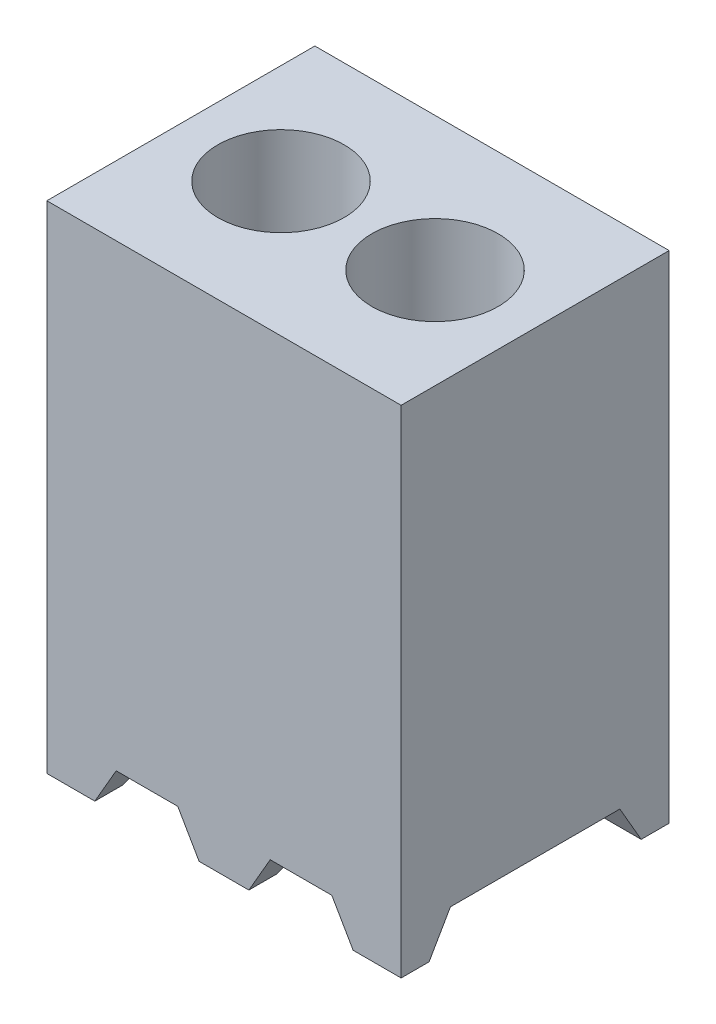
ISO-10303-21;
HEADER;
FILE_DESCRIPTION(('STEP AP214'),'2;1');
FILE_NAME('part.step','',(''),(''),'','','');
FILE_SCHEMA(('AUTOMOTIVE_DESIGN { 1 0 10303 214 1 1 1 1 }'));
ENDSEC;
DATA;
#1=APPLICATION_CONTEXT('core data for automotive mechanical design processes');
#2=APPLICATION_PROTOCOL_DEFINITION('international standard','automotive_design',2000,#1);
#3=PRODUCT_CONTEXT('',#1,'mechanical');
#4=PRODUCT('Part','Part','',(#3));
#5=PRODUCT_RELATED_PRODUCT_CATEGORY('part','',(#4));
#6=PRODUCT_DEFINITION_FORMATION('','',#4);
#7=PRODUCT_DEFINITION_CONTEXT('part definition',#1,'design');
#8=PRODUCT_DEFINITION('design','',#6,#7);
#9=PRODUCT_DEFINITION_SHAPE('','',#8);
#10=(LENGTH_UNIT() NAMED_UNIT(*) SI_UNIT(.MILLI.,.METRE.));
#11=(NAMED_UNIT(*) PLANE_ANGLE_UNIT() SI_UNIT($,.RADIAN.));
#12=(NAMED_UNIT(*) SI_UNIT($,.STERADIAN.) SOLID_ANGLE_UNIT());
#13=UNCERTAINTY_MEASURE_WITH_UNIT(LENGTH_MEASURE(1.E-05),#10,'distance_accuracy_value','');
#14=(GEOMETRIC_REPRESENTATION_CONTEXT(3) GLOBAL_UNCERTAINTY_ASSIGNED_CONTEXT((#13)) GLOBAL_UNIT_ASSIGNED_CONTEXT((#10,
#11,#12)) REPRESENTATION_CONTEXT('',''));
#15=CARTESIAN_POINT('',(0.,0.,0.));
#16=DIRECTION('',(0.,0.,1.));
#17=DIRECTION('',(1.,0.,0.));
#18=AXIS2_PLACEMENT_3D('',#15,#16,#17);
#19=CARTESIAN_POINT('',(0.,-4.0894,0.));
#20=DIRECTION('',(0.,1.,0.));
#21=DIRECTION('',(0.,0.,1.));
#22=AXIS2_PLACEMENT_3D('',#19,#20,#21);
#23=PLANE('',#22);
#24=DIRECTION('',(1.,0.,0.));
#25=VECTOR('',#24,1.);
#26=CARTESIAN_POINT('',(0.,-4.0894,0.));
#27=LINE('',#26,#25);
#28=CARTESIAN_POINT('',(2.525476362049,-4.0894,0.));
#29=VERTEX_POINT('',#28);
#30=CARTESIAN_POINT('',(2.92099999999999,-4.0894,0.));
#31=VERTEX_POINT('',#30);
#32=EDGE_CURVE('E309',#29,#31,#27,.T.);
#33=ORIENTED_EDGE('',*,*,#32,.F.);
#34=DIRECTION('',(0.,0.,1.));
#35=VECTOR('',#34,1.);
#36=CARTESIAN_POINT('',(2.525476362049,-4.0894,-2.2098));
#37=LINE('',#36,#35);
#38=CARTESIAN_POINT('',(2.525476362049,-4.0894,-0.230423637951));
#39=VERTEX_POINT('',#38);
#40=EDGE_CURVE('E216',#39,#29,#37,.T.);
#41=ORIENTED_EDGE('',*,*,#40,.F.);
#42=DIRECTION('',(1.,0.,0.));
#43=VECTOR('',#42,1.);
#44=CARTESIAN_POINT('',(0.,-4.0894,-0.230423637951));
#45=LINE('',#44,#43);
#46=CARTESIAN_POINT('',(2.92099999999999,-4.0894,-0.230423637951));
#47=VERTEX_POINT('',#46);
#48=EDGE_CURVE('E26',#39,#47,#45,.T.);
#49=ORIENTED_EDGE('',*,*,#48,.T.);
#50=DIRECTION('',(0.,0.,-1.));
#51=VECTOR('',#50,1.);
#52=CARTESIAN_POINT('',(2.92099999999999,-4.0894,0.));
#53=LINE('',#52,#51);
#54=EDGE_CURVE('E316',#31,#47,#53,.T.);
#55=ORIENTED_EDGE('',*,*,#54,.F.);
#56=EDGE_LOOP('',(#33,#41,#49,#55));
#57=FACE_BOUND('',#56,.T.);
#58=ADVANCED_FACE('F16',(#57),#23,.F.);
#59=DIRECTION('',(-1.,0.,0.));
#60=VECTOR('',#59,1.);
#61=CARTESIAN_POINT('',(0.,-4.0894,-1.97937636204899));
#62=LINE('',#61,#60);
#63=CARTESIAN_POINT('',(2.92099999999999,-4.0894,-1.97937636204899));
#64=VERTEX_POINT('',#63);
#65=CARTESIAN_POINT('',(2.525476362049,-4.0894,-1.97937636204899));
#66=VERTEX_POINT('',#65);
#67=EDGE_CURVE('E343',#64,#66,#62,.T.);
#68=ORIENTED_EDGE('',*,*,#67,.T.);
#69=CARTESIAN_POINT('',(2.525476362049,-4.0894,-2.2098));
#70=VERTEX_POINT('',#69);
#71=EDGE_CURVE('E214',#70,#66,#37,.T.);
#72=ORIENTED_EDGE('',*,*,#71,.F.);
#73=DIRECTION('',(-1.,0.,0.));
#74=VECTOR('',#73,1.);
#75=CARTESIAN_POINT('',(2.92099999999999,-4.0894,-2.20979999999999));
#76=LINE('',#75,#74);
#77=CARTESIAN_POINT('',(2.92099999999999,-4.0894,-2.20979999999999));
#78=VERTEX_POINT('',#77);
#79=EDGE_CURVE('E320',#78,#70,#76,.T.);
#80=ORIENTED_EDGE('',*,*,#79,.F.);
#81=EDGE_CURVE('E314',#64,#78,#53,.T.);
#82=ORIENTED_EDGE('',*,*,#81,.F.);
#83=EDGE_LOOP('',(#68,#72,#80,#82));
#84=FACE_BOUND('',#83,.T.);
#85=ADVANCED_FACE('F395',(#84),#23,.F.);
#86=CARTESIAN_POINT('',(-60.96,-3.7846,-0.4064));
#87=DIRECTION('',(0.,0.500000000000004,0.866025403784436));
#88=DIRECTION('',(0.,-0.866025403784436,0.500000000000004));
#89=AXIS2_PLACEMENT_3D('',#86,#87,#88);
#90=PLANE('',#89);
#91=ORIENTED_EDGE('',*,*,#48,.F.);
#92=DIRECTION('',(-0.447213595499954,0.774596669241483,-0.447213595499962));
#93=VECTOR('',#92,1.);
#94=CARTESIAN_POINT('',(-10.3123999999998,18.1464541203562,-13.0683));
#95=LINE('',#94,#93);
#96=CARTESIAN_POINT('',(2.3495,-3.7846,-0.4064));
#97=VERTEX_POINT('',#96);
#98=EDGE_CURVE('E225',#39,#97,#95,.T.);
#99=ORIENTED_EDGE('',*,*,#98,.T.);
#100=DIRECTION('',(1.,0.,0.));
#101=VECTOR('',#100,1.);
#102=CARTESIAN_POINT('',(-60.96,-3.7846,-0.4064));
#103=LINE('',#102,#101);
#104=CARTESIAN_POINT('',(2.92099999999999,-3.7846,-0.4064));
#105=VERTEX_POINT('',#104);
#106=EDGE_CURVE('E295',#97,#105,#103,.T.);
#107=ORIENTED_EDGE('',*,*,#106,.T.);
#108=DIRECTION('',(0.,-0.866025403784436,0.500000000000004));
#109=VECTOR('',#108,1.);
#110=CARTESIAN_POINT('',(2.92099999999999,-3.7846,-0.4064));
#111=LINE('',#110,#109);
#112=EDGE_CURVE('E280',#105,#47,#111,.T.);
#113=ORIENTED_EDGE('',*,*,#112,.T.);
#114=EDGE_LOOP('',(#91,#99,#107,#113));
#115=FACE_BOUND('',#114,.T.);
#116=ADVANCED_FACE('F401',(#115),#90,.F.);
#117=CARTESIAN_POINT('',(-60.96,-3.7846,-1.80339999999999));
#118=DIRECTION('',(0.,0.500000000000007,-0.866025403784434));
#119=DIRECTION('',(0.,0.866025403784434,0.500000000000007));
#120=AXIS2_PLACEMENT_3D('',#117,#118,#119);
#121=PLANE('',#120);
#122=DIRECTION('',(1.,0.,0.));
#123=VECTOR('',#122,1.);
#124=CARTESIAN_POINT('',(-60.96,-3.7846,-1.80339999999999));
#125=LINE('',#124,#123);
#126=CARTESIAN_POINT('',(2.3495,-3.7846,-1.80339999999999));
#127=VERTEX_POINT('',#126);
#128=CARTESIAN_POINT('',(2.92099999999999,-3.7846,-1.80339999999999));
#129=VERTEX_POINT('',#128);
#130=EDGE_CURVE('E289',#127,#129,#125,.T.);
#131=ORIENTED_EDGE('',*,*,#130,.F.);
#132=DIRECTION('',(0.447213595499953,-0.774596669241482,-0.447213595499966));
#133=VECTOR('',#132,1.);
#134=CARTESIAN_POINT('',(-10.3123999999997,18.1464541203561,10.8585000000001));
#135=LINE('',#134,#133);
#136=EDGE_CURVE('E222',#127,#66,#135,.T.);
#137=ORIENTED_EDGE('',*,*,#136,.T.);
#138=ORIENTED_EDGE('',*,*,#67,.F.);
#139=DIRECTION('',(0.,0.866025403784434,0.500000000000007));
#140=VECTOR('',#139,1.);
#141=CARTESIAN_POINT('',(2.92099999999999,-3.7846,-1.80339999999999));
#142=LINE('',#141,#140);
#143=EDGE_CURVE('E283',#64,#129,#142,.T.);
#144=ORIENTED_EDGE('',*,*,#143,.T.);
#145=EDGE_LOOP('',(#131,#137,#138,#144));
#146=FACE_BOUND('',#145,.T.);
#147=ADVANCED_FACE('F426',(#146),#121,.F.);
#148=CARTESIAN_POINT('',(1.255476362049,-4.0894,-0.230423637951));
#149=VERTEX_POINT('',#148);
#150=CARTESIAN_POINT('',(1.665523637951,-4.0894,-0.230423637950998));
#151=VERTEX_POINT('',#150);
#152=EDGE_CURVE('E25',#149,#151,#45,.T.);
#153=ORIENTED_EDGE('',*,*,#152,.T.);
#154=DIRECTION('',(0.,0.,1.));
#155=VECTOR('',#154,1.);
#156=CARTESIAN_POINT('',(1.665523637951,-4.0894,-2.2098));
#157=LINE('',#156,#155);
#158=CARTESIAN_POINT('',(1.665523637951,-4.0894,0.));
#159=VERTEX_POINT('',#158);
#160=EDGE_CURVE('E190',#151,#159,#157,.T.);
#161=ORIENTED_EDGE('',*,*,#160,.T.);
#162=CARTESIAN_POINT('',(1.255476362049,-4.0894,0.));
#163=VERTEX_POINT('',#162);
#164=EDGE_CURVE('E315',#163,#159,#27,.T.);
#165=ORIENTED_EDGE('',*,*,#164,.F.);
#166=DIRECTION('',(0.,0.,1.));
#167=VECTOR('',#166,1.);
#168=CARTESIAN_POINT('',(1.255476362049,-4.0894,-2.2098));
#169=LINE('',#168,#167);
#170=EDGE_CURVE('E253',#149,#163,#169,.T.);
#171=ORIENTED_EDGE('',*,*,#170,.F.);
#172=EDGE_LOOP('',(#153,#161,#165,#171));
#173=FACE_BOUND('',#172,.T.);
#174=ADVANCED_FACE('F402',(#173),#23,.F.);
#175=CARTESIAN_POINT('',(1.665523637951,-4.0894,-2.2098));
#176=VERTEX_POINT('',#175);
#177=CARTESIAN_POINT('',(1.255476362049,-4.0894,-2.2098));
#178=VERTEX_POINT('',#177);
#179=EDGE_CURVE('E323',#176,#178,#76,.T.);
#180=ORIENTED_EDGE('',*,*,#179,.F.);
#181=CARTESIAN_POINT('',(1.665523637951,-4.0894,-1.97937636204899));
#182=VERTEX_POINT('',#181);
#183=EDGE_CURVE('E33',#176,#182,#157,.T.);
#184=ORIENTED_EDGE('',*,*,#183,.T.);
#185=CARTESIAN_POINT('',(1.255476362049,-4.0894,-1.97937636204899));
#186=VERTEX_POINT('',#185);
#187=EDGE_CURVE('E345',#182,#186,#62,.T.);
#188=ORIENTED_EDGE('',*,*,#187,.T.);
#189=EDGE_CURVE('E250',#178,#186,#169,.T.);
#190=ORIENTED_EDGE('',*,*,#189,.F.);
#191=EDGE_LOOP('',(#180,#184,#188,#190));
#192=FACE_BOUND('',#191,.T.);
#193=ADVANCED_FACE('F372',(#192),#23,.F.);
#194=CARTESIAN_POINT('',(1.0795,-3.7846,-0.4064));
#195=VERTEX_POINT('',#194);
#196=CARTESIAN_POINT('',(1.8415,-3.7846,-0.4064));
#197=VERTEX_POINT('',#196);
#198=EDGE_CURVE('E294',#195,#197,#103,.T.);
#199=ORIENTED_EDGE('',*,*,#198,.T.);
#200=DIRECTION('',(-0.447213595499953,-0.774596669241483,0.447213595499963));
#201=VECTOR('',#200,1.);
#202=CARTESIAN_POINT('',(-10.7187999999998,-25.5396777583071,12.1539));
#203=LINE('',#202,#201);
#204=EDGE_CURVE('E219',#197,#151,#203,.T.);
#205=ORIENTED_EDGE('',*,*,#204,.T.);
#206=ORIENTED_EDGE('',*,*,#152,.F.);
#207=DIRECTION('',(-0.447213595499954,0.774596669241483,-0.447213595499962));
#208=VECTOR('',#207,1.);
#209=CARTESIAN_POINT('',(-11.3283999999998,17.7065132152337,-12.8143));
#210=LINE('',#209,#208);
#211=EDGE_CURVE('E268',#149,#195,#210,.T.);
#212=ORIENTED_EDGE('',*,*,#211,.T.);
#213=EDGE_LOOP('',(#199,#205,#206,#212));
#214=FACE_BOUND('',#213,.T.);
#215=ADVANCED_FACE('F424',(#214),#90,.F.);
#216=ORIENTED_EDGE('',*,*,#187,.F.);
#217=DIRECTION('',(0.447213595499952,0.774596669241482,0.447213595499966));
#218=VECTOR('',#217,1.);
#219=CARTESIAN_POINT('',(-10.7187999999997,-25.5396777583071,-14.3637000000001));
#220=LINE('',#219,#218);
#221=CARTESIAN_POINT('',(1.8415,-3.7846,-1.80339999999999));
#222=VERTEX_POINT('',#221);
#223=EDGE_CURVE('E212',#182,#222,#220,.T.);
#224=ORIENTED_EDGE('',*,*,#223,.T.);
#225=CARTESIAN_POINT('',(1.0795,-3.7846,-1.80339999999999));
#226=VERTEX_POINT('',#225);
#227=EDGE_CURVE('E188',#226,#222,#125,.T.);
#228=ORIENTED_EDGE('',*,*,#227,.F.);
#229=DIRECTION('',(0.447213595499953,-0.774596669241482,-0.447213595499966));
#230=VECTOR('',#229,1.);
#231=CARTESIAN_POINT('',(-11.3283999999997,17.7065132152336,10.6045000000001));
#232=LINE('',#231,#230);
#233=EDGE_CURVE('E265',#226,#186,#232,.T.);
#234=ORIENTED_EDGE('',*,*,#233,.T.);
#235=EDGE_LOOP('',(#216,#224,#228,#234));
#236=FACE_BOUND('',#235,.T.);
#237=ADVANCED_FACE('F375',(#236),#121,.F.);
#238=CARTESIAN_POINT('',(0.,-4.0894,-0.230423637951));
#239=VERTEX_POINT('',#238);
#240=CARTESIAN_POINT('',(0.395523637950998,-4.0894,-0.230423637950998));
#241=VERTEX_POINT('',#240);
#242=EDGE_CURVE('E11',#239,#241,#45,.T.);
#243=ORIENTED_EDGE('',*,*,#242,.T.);
#244=DIRECTION('',(0.,0.,1.));
#245=VECTOR('',#244,1.);
#246=CARTESIAN_POINT('',(0.395523637951004,-4.0894,-2.2098));
#247=LINE('',#246,#245);
#248=CARTESIAN_POINT('',(0.395523637951004,-4.0894,0.));
#249=VERTEX_POINT('',#248);
#250=EDGE_CURVE('E257',#241,#249,#247,.T.);
#251=ORIENTED_EDGE('',*,*,#250,.T.);
#252=CARTESIAN_POINT('',(0.,-4.0894,0.));
#253=VERTEX_POINT('',#252);
#254=EDGE_CURVE('E311',#253,#249,#27,.T.);
#255=ORIENTED_EDGE('',*,*,#254,.F.);
#256=DIRECTION('',(0.,0.,1.));
#257=VECTOR('',#256,1.);
#258=CARTESIAN_POINT('',(0.,-4.0894,-2.2098));
#259=LINE('',#258,#257);
#260=EDGE_CURVE('E310',#239,#253,#259,.T.);
#261=ORIENTED_EDGE('',*,*,#260,.F.);
#262=EDGE_LOOP('',(#243,#251,#255,#261));
#263=FACE_BOUND('',#262,.T.);
#264=ADVANCED_FACE('F409',(#263),#23,.F.);
#265=CARTESIAN_POINT('',(0.,-4.0894,-2.2098));
#266=DIRECTION('',(-1.,0.,0.));
#267=DIRECTION('',(0.,0.,1.));
#268=AXIS2_PLACEMENT_3D('',#265,#266,#267);
#269=PLANE('',#268);
#270=DIRECTION('',(0.,0.866025403784436,-0.500000000000004));
#271=VECTOR('',#270,1.);
#272=CARTESIAN_POINT('',(0.,-3.23230489340757,-0.725267728463258));
#273=LINE('',#272,#271);
#274=CARTESIAN_POINT('',(0.,-3.7846,-0.4064));
#275=VERTEX_POINT('',#274);
#276=EDGE_CURVE('E301',#239,#275,#273,.T.);
#277=ORIENTED_EDGE('',*,*,#276,.F.);
#278=ORIENTED_EDGE('',*,*,#260,.T.);
#279=DIRECTION('',(0.,1.,0.));
#280=VECTOR('',#279,1.);
#281=CARTESIAN_POINT('',(0.,-4.0894,0.));
#282=LINE('',#281,#280);
#283=CARTESIAN_POINT('',(0.,0.,0.));
#284=VERTEX_POINT('',#283);
#285=EDGE_CURVE('E322',#253,#284,#282,.T.);
#286=ORIENTED_EDGE('',*,*,#285,.T.);
#287=DIRECTION('',(0.,0.,1.));
#288=VECTOR('',#287,1.);
#289=CARTESIAN_POINT('',(0.,0.,-2.2098));
#290=LINE('',#289,#288);
#291=CARTESIAN_POINT('',(0.,0.,-2.2098));
#292=VERTEX_POINT('',#291);
#293=EDGE_CURVE('E305',#292,#284,#290,.T.);
#294=ORIENTED_EDGE('',*,*,#293,.F.);
#295=DIRECTION('',(0.,1.,0.));
#296=VECTOR('',#295,1.);
#297=CARTESIAN_POINT('',(0.,-4.0894,-2.2098));
#298=LINE('',#297,#296);
#299=CARTESIAN_POINT('',(0.,-4.0894,-2.2098));
#300=VERTEX_POINT('',#299);
#301=EDGE_CURVE('E335',#300,#292,#298,.T.);
#302=ORIENTED_EDGE('',*,*,#301,.F.);
#303=CARTESIAN_POINT('',(0.,-4.0894,-1.97937636204899));
#304=VERTEX_POINT('',#303);
#305=EDGE_CURVE('E306',#300,#304,#259,.T.);
#306=ORIENTED_EDGE('',*,*,#305,.T.);
#307=DIRECTION('',(0.,-0.866025403784434,-0.500000000000007));
#308=VECTOR('',#307,1.);
#309=CARTESIAN_POINT('',(0.,-4.189176362049,-2.03698227153674));
#310=LINE('',#309,#308);
#311=CARTESIAN_POINT('',(0.,-3.7846,-1.80339999999999));
#312=VERTEX_POINT('',#311);
#313=EDGE_CURVE('E293',#312,#304,#310,.T.);
#314=ORIENTED_EDGE('',*,*,#313,.F.);
#315=DIRECTION('',(0.,0.,-1.));
#316=VECTOR('',#315,1.);
#317=CARTESIAN_POINT('',(0.,-3.7846,-2.2098));
#318=LINE('',#317,#316);
#319=EDGE_CURVE('E303',#275,#312,#318,.T.);
#320=ORIENTED_EDGE('',*,*,#319,.F.);
#321=EDGE_LOOP('',(#277,#278,#286,#294,#302,#306,#314,#320));
#322=FACE_BOUND('',#321,.T.);
#323=ADVANCED_FACE('F18',(#322),#269,.T.);
#324=CARTESIAN_POINT('',(2.92099999999999,-4.0894,-2.20979999999999));
#325=DIRECTION('',(0.,0.,-1.));
#326=DIRECTION('',(-1.,0.,0.));
#327=AXIS2_PLACEMENT_3D('',#324,#325,#326);
#328=PLANE('',#327);
#329=DIRECTION('',(-0.499999999999997,0.866025403784441,0.));
#330=VECTOR('',#329,1.);
#331=CARTESIAN_POINT('',(2.525476362049,-4.0894,-2.2098));
#332=LINE('',#331,#330);
#333=CARTESIAN_POINT('',(2.3495,-3.7846,-2.2098));
#334=VERTEX_POINT('',#333);
#335=EDGE_CURVE('E197',#70,#334,#332,.T.);
#336=ORIENTED_EDGE('',*,*,#335,.T.);
#337=DIRECTION('',(-1.,0.,0.));
#338=VECTOR('',#337,1.);
#339=CARTESIAN_POINT('',(1.8415,-3.7846,-2.2098));
#340=LINE('',#339,#338);
#341=CARTESIAN_POINT('',(1.8415,-3.7846,-2.2098));
#342=VERTEX_POINT('',#341);
#343=EDGE_CURVE('E184',#334,#342,#340,.T.);
#344=ORIENTED_EDGE('',*,*,#343,.T.);
#345=DIRECTION('',(-0.499999999999996,-0.866025403784441,0.));
#346=VECTOR('',#345,1.);
#347=CARTESIAN_POINT('',(1.665523637951,-4.0894,-2.2098));
#348=LINE('',#347,#346);
#349=EDGE_CURVE('E193',#342,#176,#348,.T.);
#350=ORIENTED_EDGE('',*,*,#349,.T.);
#351=ORIENTED_EDGE('',*,*,#179,.T.);
#352=DIRECTION('',(-0.499999999999997,0.866025403784441,0.));
#353=VECTOR('',#352,1.);
#354=CARTESIAN_POINT('',(1.255476362049,-4.0894,-2.2098));
#355=LINE('',#354,#353);
#356=CARTESIAN_POINT('',(1.0795,-3.7846,-2.2098));
#357=VERTEX_POINT('',#356);
#358=EDGE_CURVE('E236',#178,#357,#355,.T.);
#359=ORIENTED_EDGE('',*,*,#358,.T.);
#360=DIRECTION('',(-1.,0.,0.));
#361=VECTOR('',#360,1.);
#362=CARTESIAN_POINT('',(0.5715,-3.7846,-2.2098));
#363=LINE('',#362,#361);
#364=CARTESIAN_POINT('',(0.5715,-3.7846,-2.2098));
#365=VERTEX_POINT('',#364);
#366=EDGE_CURVE('E229',#357,#365,#363,.T.);
#367=ORIENTED_EDGE('',*,*,#366,.T.);
#368=DIRECTION('',(-0.499999999999996,-0.866025403784441,0.));
#369=VECTOR('',#368,1.);
#370=CARTESIAN_POINT('',(0.395523637951004,-4.0894,-2.2098));
#371=LINE('',#370,#369);
#372=CARTESIAN_POINT('',(0.395523637951004,-4.0894,-2.2098));
#373=VERTEX_POINT('',#372);
#374=EDGE_CURVE('E232',#365,#373,#371,.T.);
#375=ORIENTED_EDGE('',*,*,#374,.T.);
#376=EDGE_CURVE('E319',#373,#300,#76,.T.);
#377=ORIENTED_EDGE('',*,*,#376,.T.);
#378=ORIENTED_EDGE('',*,*,#301,.T.);
#379=DIRECTION('',(-1.,0.,0.));
#380=VECTOR('',#379,1.);
#381=CARTESIAN_POINT('',(2.92099999999999,0.,-2.20979999999999));
#382=LINE('',#381,#380);
#383=CARTESIAN_POINT('',(2.92099999999999,0.,-2.20979999999999));
#384=VERTEX_POINT('',#383);
#385=EDGE_CURVE('E332',#384,#292,#382,.T.);
#386=ORIENTED_EDGE('',*,*,#385,.F.);
#387=DIRECTION('',(0.,1.,0.));
#388=VECTOR('',#387,1.);
#389=CARTESIAN_POINT('',(2.92099999999999,-4.0894,-2.20979999999999));
#390=LINE('',#389,#388);
#391=EDGE_CURVE('E338',#78,#384,#390,.T.);
#392=ORIENTED_EDGE('',*,*,#391,.F.);
#393=ORIENTED_EDGE('',*,*,#79,.T.);
#394=EDGE_LOOP('',(#336,#344,#350,#351,#359,#367,#375,#377,#378,#386,#392,#393));
#395=FACE_BOUND('',#394,.T.);
#396=ADVANCED_FACE('F199',(#395),#328,.T.);
#397=CARTESIAN_POINT('',(2.92099999999999,-4.0894,0.));
#398=DIRECTION('',(1.,0.,0.));
#399=DIRECTION('',(0.,0.,-1.));
#400=AXIS2_PLACEMENT_3D('',#397,#398,#399);
#401=PLANE('',#400);
#402=ORIENTED_EDGE('',*,*,#112,.F.);
#403=DIRECTION('',(0.,0.,1.));
#404=VECTOR('',#403,1.);
#405=CARTESIAN_POINT('',(2.92099999999999,-3.7846,-0.4064));
#406=LINE('',#405,#404);
#407=EDGE_CURVE('E286',#129,#105,#406,.T.);
#408=ORIENTED_EDGE('',*,*,#407,.F.);
#409=ORIENTED_EDGE('',*,*,#143,.F.);
#410=ORIENTED_EDGE('',*,*,#81,.T.);
#411=ORIENTED_EDGE('',*,*,#391,.T.);
#412=DIRECTION('',(0.,0.,-1.));
#413=VECTOR('',#412,1.);
#414=CARTESIAN_POINT('',(2.92099999999999,0.,0.));
#415=LINE('',#414,#413);
#416=CARTESIAN_POINT('',(2.92099999999999,0.,0.));
#417=VERTEX_POINT('',#416);
#418=EDGE_CURVE('E329',#417,#384,#415,.T.);
#419=ORIENTED_EDGE('',*,*,#418,.F.);
#420=DIRECTION('',(0.,1.,0.));
#421=VECTOR('',#420,1.);
#422=CARTESIAN_POINT('',(2.92099999999999,-4.0894,0.));
#423=LINE('',#422,#421);
#424=EDGE_CURVE('E340',#31,#417,#423,.T.);
#425=ORIENTED_EDGE('',*,*,#424,.F.);
#426=ORIENTED_EDGE('',*,*,#54,.T.);
#427=EDGE_LOOP('',(#402,#408,#409,#410,#411,#419,#425,#426));
#428=FACE_BOUND('',#427,.T.);
#429=ADVANCED_FACE('F416',(#428),#401,.T.);
#430=CARTESIAN_POINT('',(0.,-4.0894,0.));
#431=DIRECTION('',(0.,0.,1.));
#432=DIRECTION('',(1.,0.,0.));
#433=AXIS2_PLACEMENT_3D('',#430,#431,#432);
#434=PLANE('',#433);
#435=DIRECTION('',(-0.499999999999997,0.866025403784441,0.));
#436=VECTOR('',#435,1.);
#437=CARTESIAN_POINT('',(2.525476362049,-4.0894,0.));
#438=LINE('',#437,#436);
#439=CARTESIAN_POINT('',(2.3495,-3.7846,0.));
#440=VERTEX_POINT('',#439);
#441=EDGE_CURVE('E201',#29,#440,#438,.T.);
#442=ORIENTED_EDGE('',*,*,#441,.F.);
#443=ORIENTED_EDGE('',*,*,#32,.T.);
#444=ORIENTED_EDGE('',*,*,#424,.T.);
#445=DIRECTION('',(1.,0.,0.));
#446=VECTOR('',#445,1.);
#447=CARTESIAN_POINT('',(0.,0.,0.));
#448=LINE('',#447,#446);
#449=EDGE_CURVE('E326',#284,#417,#448,.T.);
#450=ORIENTED_EDGE('',*,*,#449,.F.);
#451=ORIENTED_EDGE('',*,*,#285,.F.);
#452=ORIENTED_EDGE('',*,*,#254,.T.);
#453=DIRECTION('',(-0.499999999999996,-0.866025403784441,0.));
#454=VECTOR('',#453,1.);
#455=CARTESIAN_POINT('',(0.395523637951004,-4.0894,0.));
#456=LINE('',#455,#454);
#457=CARTESIAN_POINT('',(0.5715,-3.7846,0.));
#458=VERTEX_POINT('',#457);
#459=EDGE_CURVE('E242',#458,#249,#456,.T.);
#460=ORIENTED_EDGE('',*,*,#459,.F.);
#461=DIRECTION('',(-1.,0.,0.));
#462=VECTOR('',#461,1.);
#463=CARTESIAN_POINT('',(0.5715,-3.7846,0.));
#464=LINE('',#463,#462);
#465=CARTESIAN_POINT('',(1.0795,-3.7846,0.));
#466=VERTEX_POINT('',#465);
#467=EDGE_CURVE('E228',#466,#458,#464,.T.);
#468=ORIENTED_EDGE('',*,*,#467,.F.);
#469=DIRECTION('',(-0.499999999999997,0.866025403784441,0.));
#470=VECTOR('',#469,1.);
#471=CARTESIAN_POINT('',(1.255476362049,-4.0894,0.));
#472=LINE('',#471,#470);
#473=EDGE_CURVE('E233',#163,#466,#472,.T.);
#474=ORIENTED_EDGE('',*,*,#473,.F.);
#475=ORIENTED_EDGE('',*,*,#164,.T.);
#476=DIRECTION('',(-0.499999999999996,-0.866025403784441,0.));
#477=VECTOR('',#476,1.);
#478=CARTESIAN_POINT('',(1.665523637951,-4.0894,0.));
#479=LINE('',#478,#477);
#480=CARTESIAN_POINT('',(1.8415,-3.7846,0.));
#481=VERTEX_POINT('',#480);
#482=EDGE_CURVE('E204',#481,#159,#479,.T.);
#483=ORIENTED_EDGE('',*,*,#482,.F.);
#484=DIRECTION('',(-1.,0.,0.));
#485=VECTOR('',#484,1.);
#486=CARTESIAN_POINT('',(1.8415,-3.7846,0.));
#487=LINE('',#486,#485);
#488=EDGE_CURVE('E41',#440,#481,#487,.T.);
#489=ORIENTED_EDGE('',*,*,#488,.F.);
#490=EDGE_LOOP('',(#442,#443,#444,#450,#451,#452,#460,#468,#474,#475,#483,#489));
#491=FACE_BOUND('',#490,.T.);
#492=ADVANCED_FACE('F408',(#491),#434,.T.);
#493=ORIENTED_EDGE('',*,*,#376,.F.);
#494=CARTESIAN_POINT('',(0.395523637951003,-4.08940000000001,-1.979376362049));
#495=VERTEX_POINT('',#494);
#496=EDGE_CURVE('E254',#373,#495,#247,.T.);
#497=ORIENTED_EDGE('',*,*,#496,.T.);
#498=EDGE_CURVE('E337',#495,#304,#62,.T.);
#499=ORIENTED_EDGE('',*,*,#498,.T.);
#500=ORIENTED_EDGE('',*,*,#305,.F.);
#501=EDGE_LOOP('',(#493,#497,#499,#500));
#502=FACE_BOUND('',#501,.T.);
#503=ADVANCED_FACE('F353',(#502),#23,.F.);
#504=CARTESIAN_POINT('',(0.,0.,0.));
#505=DIRECTION('',(0.,1.,0.));
#506=DIRECTION('',(0.,0.,1.));
#507=AXIS2_PLACEMENT_3D('',#504,#505,#506);
#508=PLANE('',#507);
#509=CARTESIAN_POINT('',(2.0955,0.,-1.1049));
#510=DIRECTION('',(0.,1.,0.));
#511=DIRECTION('',(0.,0.,1.));
#512=AXIS2_PLACEMENT_3D('',#509,#510,#511);
#513=CIRCLE('',#512,0.520700000000014);
#514=CARTESIAN_POINT('',(2.0955,0.,-0.584199999999983));
#515=VERTEX_POINT('',#514);
#516=EDGE_CURVE('E271',#515,#515,#513,.T.);
#517=ORIENTED_EDGE('',*,*,#516,.F.);
#518=EDGE_LOOP('',(#517));
#519=FACE_BOUND('',#518,.T.);
#520=CARTESIAN_POINT('',(0.825499999999998,0.,-1.1049));
#521=DIRECTION('',(0.,1.,0.));
#522=DIRECTION('',(0.,0.,1.));
#523=AXIS2_PLACEMENT_3D('',#520,#521,#522);
#524=CIRCLE('',#523,0.520700000000014);
#525=CARTESIAN_POINT('',(0.825499999999998,0.,-0.584199999999986));
#526=VERTEX_POINT('',#525);
#527=EDGE_CURVE('E277',#526,#526,#524,.T.);
#528=ORIENTED_EDGE('',*,*,#527,.F.);
#529=EDGE_LOOP('',(#528));
#530=FACE_BOUND('',#529,.T.);
#531=ORIENTED_EDGE('',*,*,#293,.T.);
#532=ORIENTED_EDGE('',*,*,#449,.T.);
#533=ORIENTED_EDGE('',*,*,#418,.T.);
#534=ORIENTED_EDGE('',*,*,#385,.T.);
#535=EDGE_LOOP('',(#531,#532,#533,#534));
#536=FACE_BOUND('',#535,.T.);
#537=ADVANCED_FACE('F407',(#519,#530,#536),#508,.T.);
#538=CARTESIAN_POINT('',(0.5715,-3.7846,-0.4064));
#539=VERTEX_POINT('',#538);
#540=EDGE_CURVE('E290',#275,#539,#103,.T.);
#541=ORIENTED_EDGE('',*,*,#540,.T.);
#542=DIRECTION('',(-0.447213595499953,-0.774596669241483,0.447213595499963));
#543=VECTOR('',#542,1.);
#544=CARTESIAN_POINT('',(-11.7347999999997,-25.0997368531847,11.8999));
#545=LINE('',#544,#543);
#546=EDGE_CURVE('E262',#539,#241,#545,.T.);
#547=ORIENTED_EDGE('',*,*,#546,.T.);
#548=ORIENTED_EDGE('',*,*,#242,.F.);
#549=ORIENTED_EDGE('',*,*,#276,.T.);
#550=EDGE_LOOP('',(#541,#547,#548,#549));
#551=FACE_BOUND('',#550,.T.);
#552=ADVANCED_FACE('F414',(#551),#90,.F.);
#553=CARTESIAN_POINT('',(-60.96,-3.7846,-0.4064));
#554=DIRECTION('',(0.,1.,0.));
#555=DIRECTION('',(0.,0.,1.));
#556=AXIS2_PLACEMENT_3D('',#553,#554,#555);
#557=PLANE('',#556);
#558=CARTESIAN_POINT('',(2.0955,-3.7846,-1.1049));
#559=DIRECTION('',(0.,1.,0.));
#560=DIRECTION('',(0.,0.,1.));
#561=AXIS2_PLACEMENT_3D('',#558,#559,#560);
#562=CIRCLE('',#561,0.520700000000013);
#563=CARTESIAN_POINT('',(2.0955,-3.7846,-0.584199999999983));
#564=VERTEX_POINT('',#563);
#565=EDGE_CURVE('E274',#564,#564,#562,.T.);
#566=ORIENTED_EDGE('',*,*,#565,.T.);
#567=EDGE_LOOP('',(#566));
#568=FACE_BOUND('',#567,.T.);
#569=CARTESIAN_POINT('',(0.825499999999998,-3.7846,-1.1049));
#570=DIRECTION('',(0.,1.,0.));
#571=DIRECTION('',(0.,0.,1.));
#572=AXIS2_PLACEMENT_3D('',#569,#570,#571);
#573=CIRCLE('',#572,0.520700000000013);
#574=CARTESIAN_POINT('',(0.825499999999998,-3.7846,-0.584199999999986));
#575=VERTEX_POINT('',#574);
#576=EDGE_CURVE('E20',#575,#575,#573,.T.);
#577=ORIENTED_EDGE('',*,*,#576,.T.);
#578=EDGE_LOOP('',(#577));
#579=FACE_BOUND('',#578,.T.);
#580=ORIENTED_EDGE('',*,*,#227,.T.);
#581=DIRECTION('',(0.,0.,1.));
#582=VECTOR('',#581,1.);
#583=CARTESIAN_POINT('',(1.8415,-3.7846,-2.2098));
#584=LINE('',#583,#582);
#585=EDGE_CURVE('E180',#342,#222,#584,.T.);
#586=ORIENTED_EDGE('',*,*,#585,.F.);
#587=ORIENTED_EDGE('',*,*,#343,.F.);
#588=DIRECTION('',(0.,0.,1.));
#589=VECTOR('',#588,1.);
#590=CARTESIAN_POINT('',(2.3495,-3.7846,-2.2098));
#591=LINE('',#590,#589);
#592=EDGE_CURVE('E210',#334,#127,#591,.T.);
#593=ORIENTED_EDGE('',*,*,#592,.T.);
#594=ORIENTED_EDGE('',*,*,#130,.T.);
#595=ORIENTED_EDGE('',*,*,#407,.T.);
#596=ORIENTED_EDGE('',*,*,#106,.F.);
#597=EDGE_CURVE('E213',#97,#440,#591,.T.);
#598=ORIENTED_EDGE('',*,*,#597,.T.);
#599=ORIENTED_EDGE('',*,*,#488,.T.);
#600=EDGE_CURVE('E191',#197,#481,#584,.T.);
#601=ORIENTED_EDGE('',*,*,#600,.F.);
#602=ORIENTED_EDGE('',*,*,#198,.F.);
#603=DIRECTION('',(0.,0.,1.));
#604=VECTOR('',#603,1.);
#605=CARTESIAN_POINT('',(1.0795,-3.7846,-2.2098));
#606=LINE('',#605,#604);
#607=EDGE_CURVE('E249',#195,#466,#606,.T.);
#608=ORIENTED_EDGE('',*,*,#607,.T.);
#609=ORIENTED_EDGE('',*,*,#467,.T.);
#610=DIRECTION('',(0.,0.,1.));
#611=VECTOR('',#610,1.);
#612=CARTESIAN_POINT('',(0.5715,-3.7846,-2.2098));
#613=LINE('',#612,#611);
#614=EDGE_CURVE('E239',#539,#458,#613,.T.);
#615=ORIENTED_EDGE('',*,*,#614,.F.);
#616=ORIENTED_EDGE('',*,*,#540,.F.);
#617=ORIENTED_EDGE('',*,*,#319,.T.);
#618=CARTESIAN_POINT('',(0.571500000000023,-3.7846,-1.80339999999999));
#619=VERTEX_POINT('',#618);
#620=EDGE_CURVE('E296',#312,#619,#125,.T.);
#621=ORIENTED_EDGE('',*,*,#620,.T.);
#622=EDGE_CURVE('E258',#365,#619,#613,.T.);
#623=ORIENTED_EDGE('',*,*,#622,.F.);
#624=ORIENTED_EDGE('',*,*,#366,.F.);
#625=EDGE_CURVE('E246',#357,#226,#606,.T.);
#626=ORIENTED_EDGE('',*,*,#625,.T.);
#627=EDGE_LOOP('',(#580,#586,#587,#593,#594,#595,#596,#598,#599,#601,#602,#608,#609,#615,#616,
#617,#621,#623,#624,#626));
#628=FACE_BOUND('',#627,.T.);
#629=ADVANCED_FACE('F181',(#568,#579,#628),#557,.F.);
#630=ORIENTED_EDGE('',*,*,#498,.F.);
#631=DIRECTION('',(0.447213595499952,0.774596669241482,0.447213595499966));
#632=VECTOR('',#631,1.);
#633=CARTESIAN_POINT('',(-11.7347999999997,-25.0997368531846,-14.1097000000001));
#634=LINE('',#633,#632);
#635=EDGE_CURVE('E248',#495,#619,#634,.T.);
#636=ORIENTED_EDGE('',*,*,#635,.T.);
#637=ORIENTED_EDGE('',*,*,#620,.F.);
#638=ORIENTED_EDGE('',*,*,#313,.T.);
#639=EDGE_LOOP('',(#630,#636,#637,#638));
#640=FACE_BOUND('',#639,.T.);
#641=ADVANCED_FACE('F357',(#640),#121,.F.);
#642=CARTESIAN_POINT('',(0.825499999999998,0.,-1.1049));
#643=DIRECTION('',(0.,1.,0.));
#644=DIRECTION('',(0.,0.,1.));
#645=AXIS2_PLACEMENT_3D('',#642,#643,#644);
#646=CYLINDRICAL_SURFACE('',#645,0.520700000000013);
#647=ORIENTED_EDGE('',*,*,#527,.T.);
#648=EDGE_LOOP('',(#647));
#649=FACE_BOUND('',#648,.T.);
#650=ORIENTED_EDGE('',*,*,#576,.F.);
#651=EDGE_LOOP('',(#650));
#652=FACE_BOUND('',#651,.T.);
#653=ADVANCED_FACE('F601',(#649,#652),#646,.F.);
#654=CARTESIAN_POINT('',(2.0955,0.,-1.1049));
#655=DIRECTION('',(0.,1.,0.));
#656=DIRECTION('',(0.,0.,1.));
#657=AXIS2_PLACEMENT_3D('',#654,#655,#656);
#658=CYLINDRICAL_SURFACE('',#657,0.520700000000013);
#659=ORIENTED_EDGE('',*,*,#516,.T.);
#660=EDGE_LOOP('',(#659));
#661=FACE_BOUND('',#660,.T.);
#662=ORIENTED_EDGE('',*,*,#565,.F.);
#663=EDGE_LOOP('',(#662));
#664=FACE_BOUND('',#663,.T.);
#665=ADVANCED_FACE('F389',(#661,#664),#658,.F.);
#666=CARTESIAN_POINT('',(1.255476362049,-4.0894,-2.2098));
#667=DIRECTION('',(0.86602540378444,0.499999999999997,0.));
#668=DIRECTION('',(-0.499999999999997,0.866025403784441,0.));
#669=AXIS2_PLACEMENT_3D('',#666,#667,#668);
#670=PLANE('',#669);
#671=ORIENTED_EDGE('',*,*,#625,.F.);
#672=ORIENTED_EDGE('',*,*,#358,.F.);
#673=ORIENTED_EDGE('',*,*,#189,.T.);
#674=ORIENTED_EDGE('',*,*,#233,.F.);
#675=EDGE_LOOP('',(#671,#672,#673,#674));
#676=FACE_BOUND('',#675,.T.);
#677=ADVANCED_FACE('F370',(#676),#670,.F.);
#678=CARTESIAN_POINT('',(0.395523637951004,-4.0894,-2.2098));
#679=DIRECTION('',(-0.866025403784441,0.499999999999996,0.));
#680=DIRECTION('',(-0.499999999999996,-0.866025403784441,0.));
#681=AXIS2_PLACEMENT_3D('',#678,#679,#680);
#682=PLANE('',#681);
#683=ORIENTED_EDGE('',*,*,#496,.F.);
#684=ORIENTED_EDGE('',*,*,#374,.F.);
#685=ORIENTED_EDGE('',*,*,#622,.T.);
#686=ORIENTED_EDGE('',*,*,#635,.F.);
#687=EDGE_LOOP('',(#683,#684,#685,#686));
#688=FACE_BOUND('',#687,.T.);
#689=ADVANCED_FACE('F377',(#688),#682,.F.);
#690=ORIENTED_EDGE('',*,*,#170,.T.);
#691=ORIENTED_EDGE('',*,*,#473,.T.);
#692=ORIENTED_EDGE('',*,*,#607,.F.);
#693=ORIENTED_EDGE('',*,*,#211,.F.);
#694=EDGE_LOOP('',(#690,#691,#692,#693));
#695=FACE_BOUND('',#694,.T.);
#696=ADVANCED_FACE('F379',(#695),#670,.F.);
#697=ORIENTED_EDGE('',*,*,#614,.T.);
#698=ORIENTED_EDGE('',*,*,#459,.T.);
#699=ORIENTED_EDGE('',*,*,#250,.F.);
#700=ORIENTED_EDGE('',*,*,#546,.F.);
#701=EDGE_LOOP('',(#697,#698,#699,#700));
#702=FACE_BOUND('',#701,.T.);
#703=ADVANCED_FACE('F381',(#702),#682,.F.);
#704=CARTESIAN_POINT('',(1.665523637951,-4.0894,-2.2098));
#705=DIRECTION('',(-0.866025403784441,0.499999999999996,0.));
#706=DIRECTION('',(-0.499999999999996,-0.866025403784441,0.));
#707=AXIS2_PLACEMENT_3D('',#704,#705,#706);
#708=PLANE('',#707);
#709=ORIENTED_EDGE('',*,*,#600,.T.);
#710=ORIENTED_EDGE('',*,*,#482,.T.);
#711=ORIENTED_EDGE('',*,*,#160,.F.);
#712=ORIENTED_EDGE('',*,*,#204,.F.);
#713=EDGE_LOOP('',(#709,#710,#711,#712));
#714=FACE_BOUND('',#713,.T.);
#715=ADVANCED_FACE('F392',(#714),#708,.F.);
#716=CARTESIAN_POINT('',(2.525476362049,-4.0894,-2.2098));
#717=DIRECTION('',(0.86602540378444,0.499999999999997,0.));
#718=DIRECTION('',(-0.499999999999997,0.866025403784441,0.));
#719=AXIS2_PLACEMENT_3D('',#716,#717,#718);
#720=PLANE('',#719);
#721=ORIENTED_EDGE('',*,*,#40,.T.);
#722=ORIENTED_EDGE('',*,*,#441,.T.);
#723=ORIENTED_EDGE('',*,*,#597,.F.);
#724=ORIENTED_EDGE('',*,*,#98,.F.);
#725=EDGE_LOOP('',(#721,#722,#723,#724));
#726=FACE_BOUND('',#725,.T.);
#727=ADVANCED_FACE('F462',(#726),#720,.F.);
#728=ORIENTED_EDGE('',*,*,#592,.F.);
#729=ORIENTED_EDGE('',*,*,#335,.F.);
#730=ORIENTED_EDGE('',*,*,#71,.T.);
#731=ORIENTED_EDGE('',*,*,#136,.F.);
#732=EDGE_LOOP('',(#728,#729,#730,#731));
#733=FACE_BOUND('',#732,.T.);
#734=ADVANCED_FACE('F477',(#733),#720,.F.);
#735=ORIENTED_EDGE('',*,*,#183,.F.);
#736=ORIENTED_EDGE('',*,*,#349,.F.);
#737=ORIENTED_EDGE('',*,*,#585,.T.);
#738=ORIENTED_EDGE('',*,*,#223,.F.);
#739=EDGE_LOOP('',(#735,#736,#737,#738));
#740=FACE_BOUND('',#739,.T.);
#741=ADVANCED_FACE('F194',(#740),#708,.F.);
#742=CLOSED_SHELL('',(#58,#85,#116,#147,#174,#193,#215,#237,#264,#323,#396,#429,#492,#503,#537,
#552,#629,#641,#653,#665,#677,#689,#696,#703,#715,#727,#734,#741));
#743=MANIFOLD_SOLID_BREP('B1',#742);
#744=ADVANCED_BREP_SHAPE_REPRESENTATION('',(#18,#743),#14);
#745=SHAPE_DEFINITION_REPRESENTATION(#9,#744);
ENDSEC;
END-ISO-10303-21;
